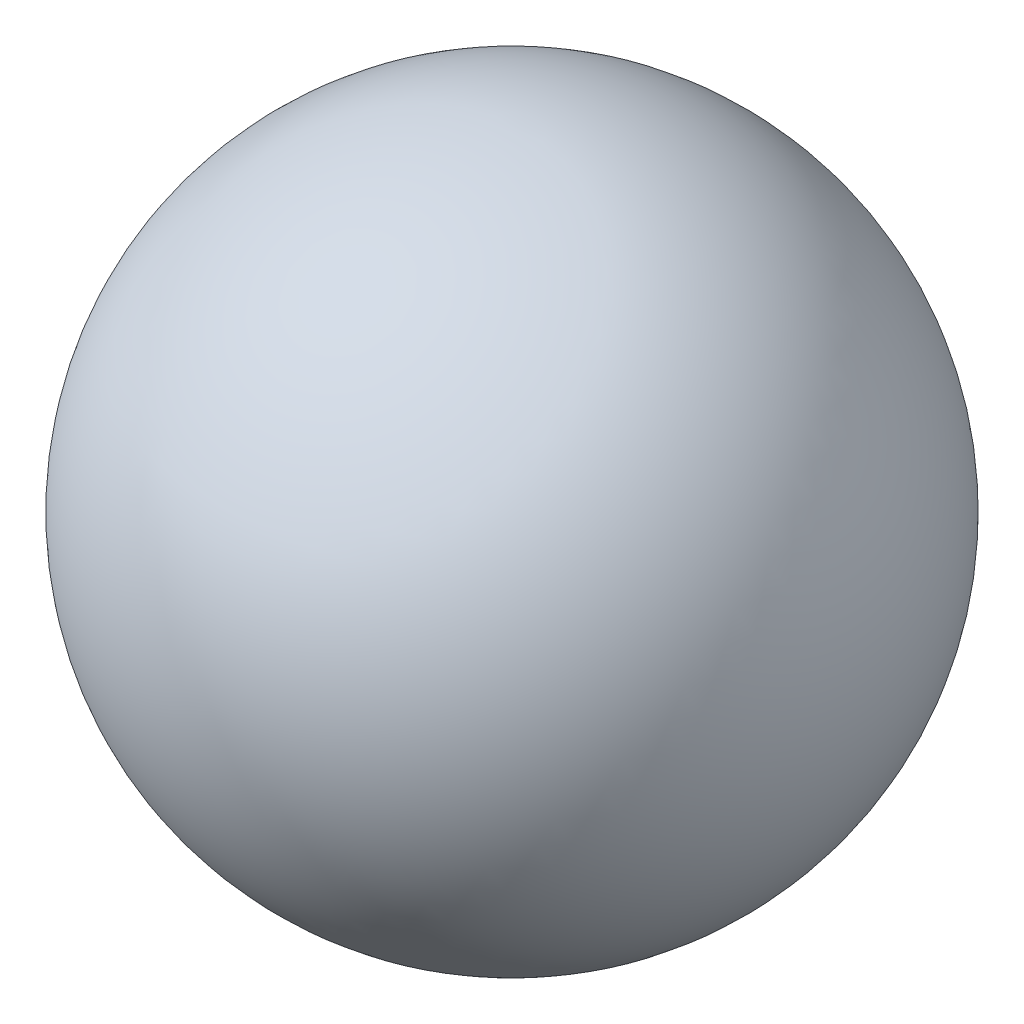
ISO-10303-21;
HEADER;
FILE_DESCRIPTION(('STEP AP214'),'2;1');
FILE_NAME('part.step','',(''),(''),'','','');
FILE_SCHEMA(('AUTOMOTIVE_DESIGN { 1 0 10303 214 1 1 1 1 }'));
ENDSEC;
DATA;
#1=APPLICATION_CONTEXT('core data for automotive mechanical design processes');
#2=APPLICATION_PROTOCOL_DEFINITION('international standard','automotive_design',2000,#1);
#3=PRODUCT_CONTEXT('',#1,'mechanical');
#4=PRODUCT('Part','Part','',(#3));
#5=PRODUCT_RELATED_PRODUCT_CATEGORY('part','',(#4));
#6=PRODUCT_DEFINITION_FORMATION('','',#4);
#7=PRODUCT_DEFINITION_CONTEXT('part definition',#1,'design');
#8=PRODUCT_DEFINITION('design','',#6,#7);
#9=PRODUCT_DEFINITION_SHAPE('','',#8);
#10=(LENGTH_UNIT() NAMED_UNIT(*) SI_UNIT(.MILLI.,.METRE.));
#11=(NAMED_UNIT(*) PLANE_ANGLE_UNIT() SI_UNIT($,.RADIAN.));
#12=(NAMED_UNIT(*) SI_UNIT($,.STERADIAN.) SOLID_ANGLE_UNIT());
#13=UNCERTAINTY_MEASURE_WITH_UNIT(LENGTH_MEASURE(1.E-05),#10,'distance_accuracy_value','');
#14=(GEOMETRIC_REPRESENTATION_CONTEXT(3) GLOBAL_UNCERTAINTY_ASSIGNED_CONTEXT((#13)) GLOBAL_UNIT_ASSIGNED_CONTEXT((#10,
#11,#12)) REPRESENTATION_CONTEXT('',''));
#15=CARTESIAN_POINT('',(0.,0.,0.));
#16=DIRECTION('',(0.,0.,1.));
#17=DIRECTION('',(1.,0.,0.));
#18=AXIS2_PLACEMENT_3D('',#15,#16,#17);
#19=CARTESIAN_POINT('',(0.,76.2,0.));
#20=DIRECTION('',(0.,-1.,0.));
#21=DIRECTION('',(-1.,0.,0.));
#22=AXIS2_PLACEMENT_3D('',#19,#20,#21);
#23=SPHERICAL_SURFACE('',#22,76.2);
#24=CARTESIAN_POINT('',(0.,0.,0.));
#25=VERTEX_POINT('',#24);
#26=VERTEX_LOOP('',#25);
#27=FACE_BOUND('',#26,.T.);
#28=ADVANCED_FACE('F31',(#27),#23,.T.);
#29=CLOSED_SHELL('',(#28));
#30=MANIFOLD_SOLID_BREP('B2',#29);
#31=ADVANCED_BREP_SHAPE_REPRESENTATION('',(#18,#30),#14);
#32=SHAPE_DEFINITION_REPRESENTATION(#9,#31);
ENDSEC;
END-ISO-10303-21;
